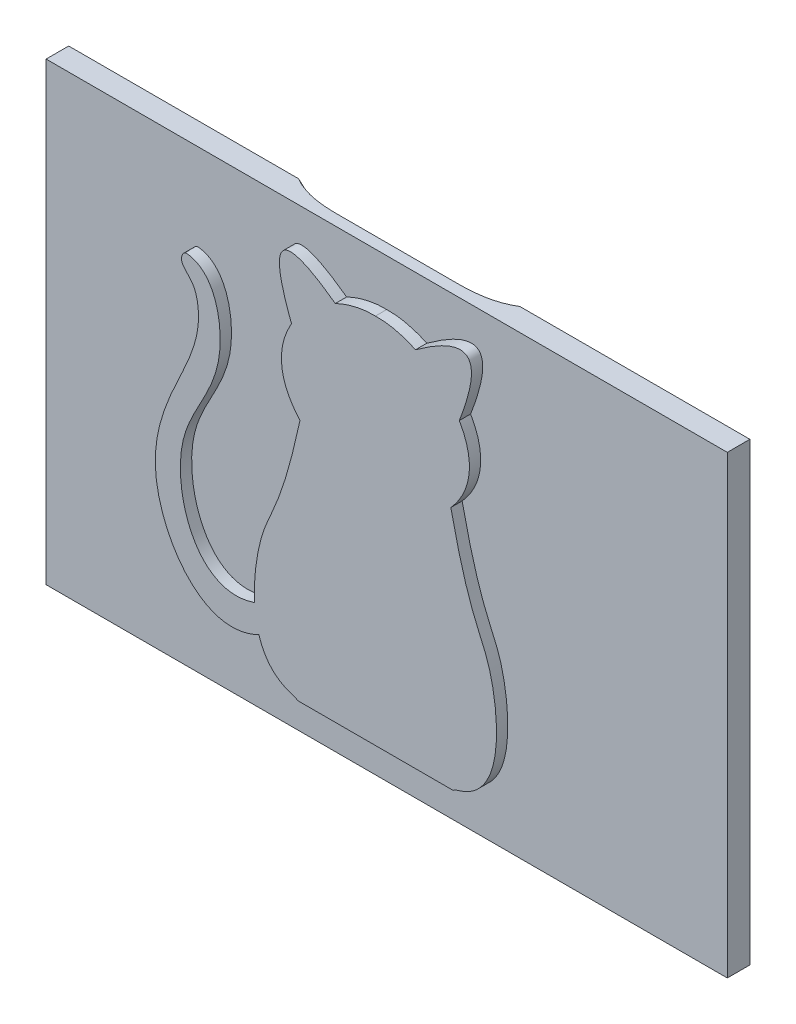
ISO-10303-21;
HEADER;
FILE_DESCRIPTION(('STEP AP214'),'2;1');
FILE_NAME('part.step','',(''),(''),'','','');
FILE_SCHEMA(('AUTOMOTIVE_DESIGN { 1 0 10303 214 1 1 1 1 }'));
ENDSEC;
DATA;
#1=APPLICATION_CONTEXT('core data for automotive mechanical design processes');
#2=APPLICATION_PROTOCOL_DEFINITION('international standard','automotive_design',2000,#1);
#3=PRODUCT_CONTEXT('',#1,'mechanical');
#4=PRODUCT('Part','Part','',(#3));
#5=PRODUCT_RELATED_PRODUCT_CATEGORY('part','',(#4));
#6=PRODUCT_DEFINITION_FORMATION('','',#4);
#7=PRODUCT_DEFINITION_CONTEXT('part definition',#1,'design');
#8=PRODUCT_DEFINITION('design','',#6,#7);
#9=PRODUCT_DEFINITION_SHAPE('','',#8);
#10=(LENGTH_UNIT() NAMED_UNIT(*) SI_UNIT(.MILLI.,.METRE.));
#11=(NAMED_UNIT(*) PLANE_ANGLE_UNIT() SI_UNIT($,.RADIAN.));
#12=(NAMED_UNIT(*) SI_UNIT($,.STERADIAN.) SOLID_ANGLE_UNIT());
#13=UNCERTAINTY_MEASURE_WITH_UNIT(LENGTH_MEASURE(1.E-05),#10,'distance_accuracy_value','');
#14=(GEOMETRIC_REPRESENTATION_CONTEXT(3) GLOBAL_UNCERTAINTY_ASSIGNED_CONTEXT((#13)) GLOBAL_UNIT_ASSIGNED_CONTEXT((#10,
#11,#12)) REPRESENTATION_CONTEXT('',''));
#15=CARTESIAN_POINT('',(0.,0.,0.));
#16=DIRECTION('',(0.,0.,1.));
#17=DIRECTION('',(1.,0.,0.));
#18=AXIS2_PLACEMENT_3D('',#15,#16,#17);
#19=CARTESIAN_POINT('',(0.,20150.,2000.));
#20=DIRECTION('',(0.,1.,0.));
#21=DIRECTION('',(0.,0.,1.));
#22=AXIS2_PLACEMENT_3D('',#19,#20,#21);
#23=PLANE('',#22);
#24=DIRECTION('',(1.,0.,0.));
#25=VECTOR('',#24,1.);
#26=CARTESIAN_POINT('',(0.,20150.,0.));
#27=LINE('',#26,#25);
#28=CARTESIAN_POINT('',(-30150.,20150.,0.));
#29=VERTEX_POINT('',#28);
#30=CARTESIAN_POINT('',(-9797.95897113271,20150.,0.));
#31=VERTEX_POINT('',#30);
#32=EDGE_CURVE('E208',#29,#31,#27,.T.);
#33=ORIENTED_EDGE('',*,*,#32,.F.);
#34=DIRECTION('',(0.,0.,-1.));
#35=VECTOR('',#34,1.);
#36=CARTESIAN_POINT('',(-30150.,20150.,2000.));
#37=LINE('',#36,#35);
#38=CARTESIAN_POINT('',(-30150.,20150.,2000.));
#39=VERTEX_POINT('',#38);
#40=EDGE_CURVE('E224',#39,#29,#37,.T.);
#41=ORIENTED_EDGE('',*,*,#40,.F.);
#42=DIRECTION('',(1.,0.,0.));
#43=VECTOR('',#42,1.);
#44=CARTESIAN_POINT('',(0.,20150.,2000.));
#45=LINE('',#44,#43);
#46=CARTESIAN_POINT('',(30150.,20150.,2000.));
#47=VERTEX_POINT('',#46);
#48=EDGE_CURVE('E193',#39,#47,#45,.T.);
#49=ORIENTED_EDGE('',*,*,#48,.T.);
#50=DIRECTION('',(0.,0.,-1.));
#51=VECTOR('',#50,1.);
#52=CARTESIAN_POINT('',(30150.,20150.,2000.));
#53=LINE('',#52,#51);
#54=CARTESIAN_POINT('',(30150.,20150.,0.));
#55=VERTEX_POINT('',#54);
#56=EDGE_CURVE('E204',#47,#55,#53,.T.);
#57=ORIENTED_EDGE('',*,*,#56,.T.);
#58=CARTESIAN_POINT('',(9797.95897113271,20150.,0.));
#59=VERTEX_POINT('',#58);
#60=EDGE_CURVE('E187',#59,#55,#27,.T.);
#61=ORIENTED_EDGE('',*,*,#60,.F.);
#62=CARTESIAN_POINT('',(9797.95897113271,20150.,0.));
#63=CARTESIAN_POINT('',(9761.41988208664,20150.,22.5524303969973));
#64=CARTESIAN_POINT('',(9724.59290965695,20150.,44.6368886990358));
#65=CARTESIAN_POINT('',(9650.40421567553,20150.,87.8800985631785));
#66=CARTESIAN_POINT('',(9613.04254796276,20150.,109.038942467927));
#67=CARTESIAN_POINT('',(9537.82892550171,20150.,150.43973974739));
#68=CARTESIAN_POINT('',(9499.97711416117,20150.,170.681953851288));
#69=CARTESIAN_POINT('',(9423.80723703039,20150.,210.269948813741));
#70=CARTESIAN_POINT('',(9385.48916577587,20150.,229.615719153738));
#71=CARTESIAN_POINT('',(9308.49734910602,20150.,267.387503724146));
#72=CARTESIAN_POINT('',(9269.82446495539,20150.,285.815274525628));
#73=CARTESIAN_POINT('',(9192.07941393921,20150.,321.807561288052));
#74=CARTESIAN_POINT('',(9153.00724832207,20150.,339.372079947082));
#75=CARTESIAN_POINT('',(9074.49020778691,20150.,373.655279892411));
#76=CARTESIAN_POINT('',(9035.04530439207,20150.,390.373895922276));
#77=CARTESIAN_POINT('',(8955.81364514149,20150.,422.980556485267));
#78=CARTESIAN_POINT('',(8916.02688760993,20150.,438.86859694404));
#79=CARTESIAN_POINT('',(8836.8109651452,20150.,469.570421122937));
#80=CARTESIAN_POINT('',(8797.38706154579,20150.,484.397789839646));
#81=CARTESIAN_POINT('',(8718.25848612919,20150.,513.282824084876));
#82=CARTESIAN_POINT('',(8678.55381464063,20150.,527.340490514192));
#83=CARTESIAN_POINT('',(8598.88754407104,20150.,554.702634011915));
#84=CARTESIAN_POINT('',(8558.92595429708,20150.,568.00713819494));
#85=CARTESIAN_POINT('',(8478.76553109691,20150.,593.880768473882));
#86=CARTESIAN_POINT('',(8438.56669751099,20150.,606.449894074668));
#87=CARTESIAN_POINT('',(8357.93380694829,20150.,630.875638376858));
#88=CARTESIAN_POINT('',(8317.49965352664,20150.,642.731938500107));
#89=CARTESIAN_POINT('',(8236.43258489967,20150.,665.743607315334));
#90=CARTESIAN_POINT('',(8195.79966999225,20150.,676.898977057513));
#91=CARTESIAN_POINT('',(8114.35182568683,20150.,698.526770563085));
#92=CARTESIAN_POINT('',(8073.53689311419,20150.,708.999182364553));
#93=CARTESIAN_POINT('',(7991.74206372828,20150.,729.278729282328));
#94=CARTESIAN_POINT('',(7950.76216602952,20150.,739.08586082247));
#95=CARTESIAN_POINT('',(7858.50608645213,20150.,760.396589253387));
#96=CARTESIAN_POINT('',(7807.18831598243,20150.,771.720430647732));
#97=CARTESIAN_POINT('',(7704.34780632885,20150.,793.395980373851));
#98=CARTESIAN_POINT('',(7652.82506524506,20150.,803.747679672729));
#99=CARTESIAN_POINT('',(7549.59858746108,20150.,823.513971140014));
#100=CARTESIAN_POINT('',(7497.89484490725,20150.,832.92853270585));
#101=CARTESIAN_POINT('',(7394.33145415384,20150.,850.854835478326));
#102=CARTESIAN_POINT('',(7342.47180634018,20150.,859.366578917874));
#103=CARTESIAN_POINT('',(7238.59593199454,20150.,875.525240622696));
#104=CARTESIAN_POINT('',(7186.57964902352,20150.,883.17179551675));
#105=CARTESIAN_POINT('',(7082.43140432684,20150.,897.630445931383));
#106=CARTESIAN_POINT('',(7030.29944253214,20150.,904.442540953801));
#107=CARTESIAN_POINT('',(6925.93880628616,20150.,917.266371578996));
#108=CARTESIAN_POINT('',(6873.71013452656,20150.,923.278129127415));
#109=CARTESIAN_POINT('',(6769.17047333221,20150.,934.535569867085));
#110=CARTESIAN_POINT('',(6716.8594838912,20150.,939.781253000134));
#111=CARTESIAN_POINT('',(6611.0109644174,20150.,949.648372844693));
#112=CARTESIAN_POINT('',(6557.47191007906,20150.,954.253425651115));
#113=CARTESIAN_POINT('',(6450.33620845274,20150.,962.734406381199));
#114=CARTESIAN_POINT('',(6396.73956110956,20150.,966.610333605291));
#115=CARTESIAN_POINT('',(6289.49839763665,20150.,973.668822035325));
#116=CARTESIAN_POINT('',(6235.85387949185,20150.,976.851352522618));
#117=CARTESIAN_POINT('',(6128.52980782957,20150.,982.558178315298));
#118=CARTESIAN_POINT('',(6074.85025419384,20150.,985.082471387182));
#119=CARTESIAN_POINT('',(5967.55761436018,20150.,989.504083146734));
#120=CARTESIAN_POINT('',(5913.94457191239,20150.,991.402468925044));
#121=CARTESIAN_POINT('',(5806.70082283496,20150.,994.612818101669));
#122=CARTESIAN_POINT('',(5753.07011612143,20150.,995.924778673908));
#123=CARTESIAN_POINT('',(5645.80722826107,20150.,997.996444094712));
#124=CARTESIAN_POINT('',(5592.17504892888,20150.,998.756243182074));
#125=CARTESIAN_POINT('',(5511.72386697199,20150.,999.507573924986));
#126=CARTESIAN_POINT('',(5484.90651642911,20150.,999.693289586324));
#127=CARTESIAN_POINT('',(5431.27127770509,20150.,999.939501294235));
#128=CARTESIAN_POINT('',(5404.45338952482,20150.,999.999997529797));
#129=CARTESIAN_POINT('',(5377.63547390407,20150.,1000.));
#130=B_SPLINE_CURVE_WITH_KNOTS('',3,(#62,#63,#64,#65,#66,#67,#68,#69,#70,#71,#72,#73,#74,#75,
#76,#77,#78,#79,#80,#81,#82,#83,#84,#85,#86,#87,#88,#89,#90,#91,#92,#93,#94,#95,#96,#97,#98,#99,
#100,#101,#102,#103,#104,#105,#106,#107,#108,#109,#110,#111,#112,#113,#114,#115,#116,#117,#118,
#119,#120,#121,#122,#123,#124,#125,#126,#127,#128,#129),.UNSPECIFIED.,.F.,.F.,(4,2,2,2,2,2,2,2,
2,2,2,2,2,2,2,2,2,2,2,2,2,2,2,2,2,2,2,2,2,2,2,2,2,4),(0.,128.810880026268,257.608879969084,
386.370011056506,515.132652599615,643.638618320394,772.144182371089,900.659644805643,
1029.17573760833,1155.52758780215,1281.87929012106,1408.22644075184,1534.5736764513,
1660.97696619724,1787.3800665492,1913.78538024221,2040.19137336382,2197.83807379027,
2355.48623888465,2513.13955034904,2670.79247188628,2828.51136233344,2986.23034693639,
3143.94500591722,3301.6596768803,3462.86463376433,3624.06974531795,3785.28199707891,
3946.4947958509,4107.43130915308,4268.36859802519,4429.27841286768,4509.73214672161,
4590.18575915103),.UNSPECIFIED.);
#131=CARTESIAN_POINT('',(5377.63547390407,20150.,1000.));
#132=VERTEX_POINT('',#131);
#133=EDGE_CURVE('E54',#59,#132,#130,.T.);
#134=ORIENTED_EDGE('',*,*,#133,.T.);
#135=DIRECTION('',(-1.,0.,0.));
#136=VECTOR('',#135,1.);
#137=CARTESIAN_POINT('',(0.,20150.,1000.));
#138=LINE('',#137,#136);
#139=CARTESIAN_POINT('',(-5377.63547390407,20150.,1000.));
#140=VERTEX_POINT('',#139);
#141=EDGE_CURVE('E184',#132,#140,#138,.T.);
#142=ORIENTED_EDGE('',*,*,#141,.T.);
#143=CARTESIAN_POINT('',(-5377.63547390407,20150.,1000.));
#144=CARTESIAN_POINT('',(-5407.23069802245,20150.,999.999996322187));
#145=CARTESIAN_POINT('',(-5436.82588665661,20150.,999.926321783097));
#146=CARTESIAN_POINT('',(-5496.01556622456,20150.,999.625940811067));
#147=CARTESIAN_POINT('',(-5525.61005715614,20150.,999.399233944681));
#148=CARTESIAN_POINT('',(-5614.39246867539,20150.,998.481017979675));
#149=CARTESIAN_POINT('',(-5673.57815100913,20150.,997.551413062674));
#150=CARTESIAN_POINT('',(-5791.94925283476,20150.,995.011138348438));
#151=CARTESIAN_POINT('',(-5851.13466881457,20150.,993.400304204505));
#152=CARTESIAN_POINT('',(-5969.48106376254,20150.,989.45128462084));
#153=CARTESIAN_POINT('',(-6028.64204288834,20150.,987.113103949059));
#154=CARTESIAN_POINT('',(-6147.09398681117,20150.,981.65509769488));
#155=CARTESIAN_POINT('',(-6206.38485226677,20150.,978.533103827698));
#156=CARTESIAN_POINT('',(-6324.91767775319,20150.,971.463286673294));
#157=CARTESIAN_POINT('',(-6384.15963768284,20150.,967.515461681938));
#158=CARTESIAN_POINT('',(-6502.57500445274,20150.,958.746418491666));
#159=CARTESIAN_POINT('',(-6561.74841574604,20150.,953.925260647257));
#160=CARTESIAN_POINT('',(-6680.01308492329,20150.,943.361110540607));
#161=CARTESIAN_POINT('',(-6739.10434292751,20150.,937.618119629322));
#162=CARTESIAN_POINT('',(-6855.71012664727,20150.,925.317202513657));
#163=CARTESIAN_POINT('',(-6913.22717210458,20150.,918.783212264086));
#164=CARTESIAN_POINT('',(-7028.14330850096,20150.,904.74716114437));
#165=CARTESIAN_POINT('',(-7085.54239943366,20150.,897.245100222029));
#166=CARTESIAN_POINT('',(-7200.20215072849,20150.,881.226744611732));
#167=CARTESIAN_POINT('',(-7257.46280390012,20150.,872.710398349097));
#168=CARTESIAN_POINT('',(-7371.81662820161,20150.,854.617750209152));
#169=CARTESIAN_POINT('',(-7428.90979958898,20150.,845.041449962462));
#170=CARTESIAN_POINT('',(-7542.84636061357,20150.,824.792125478847));
#171=CARTESIAN_POINT('',(-7599.68993445999,20150.,814.120139543702));
#172=CARTESIAN_POINT('',(-7713.1496510406,20150.,791.625659506724));
#173=CARTESIAN_POINT('',(-7769.7657923992,20150.,779.803158457061));
#174=CARTESIAN_POINT('',(-7882.73051215098,20150.,754.962352565966));
#175=CARTESIAN_POINT('',(-7939.07911345799,20150.,741.944152148172));
#176=CARTESIAN_POINT('',(-8051.47315882387,20150.,714.665265465504));
#177=CARTESIAN_POINT('',(-8107.5186097365,20150.,700.404607416447));
#178=CARTESIAN_POINT('',(-8234.44092280616,20150.,666.546023689665));
#179=CARTESIAN_POINT('',(-8305.21257216496,20150.,646.550323737403));
#180=CARTESIAN_POINT('',(-8410.87724420239,20150.,614.924243578807));
#181=CARTESIAN_POINT('',(-8446.01649962923,20150.,604.110184568524));
#182=CARTESIAN_POINT('',(-8516.11966027601,20150.,581.925681008432));
#183=CARTESIAN_POINT('',(-8551.08356423716,20150.,570.555232470755));
#184=CARTESIAN_POINT('',(-8620.81205329505,20150.,547.249804619967));
#185=CARTESIAN_POINT('',(-8655.57669044033,20150.,535.314981032406));
#186=CARTESIAN_POINT('',(-8724.90133110067,20150.,510.866722522179));
#187=CARTESIAN_POINT('',(-8759.46133807635,20150.,498.35329741629));
#188=CARTESIAN_POINT('',(-8828.3624944516,20150.,472.736264447186));
#189=CARTESIAN_POINT('',(-8862.70364193078,20150.,459.632651413476));
#190=CARTESIAN_POINT('',(-8931.15227167634,20150.,432.823738671725));
#191=CARTESIAN_POINT('',(-8965.25973960546,20150.,419.118402420803));
#192=CARTESIAN_POINT('',(-9068.26165112475,20150.,376.648347832963));
#193=CARTESIAN_POINT('',(-9136.76456263002,20150.,346.926385753337));
#194=CARTESIAN_POINT('',(-9272.57797984894,20150.,284.870885770663));
#195=CARTESIAN_POINT('',(-9339.88851252018,20150.,252.53740700153));
#196=CARTESIAN_POINT('',(-9439.87763639646,20150.,201.996560512411));
#197=CARTESIAN_POINT('',(-9473.06811773527,20150.,184.796381599608));
#198=CARTESIAN_POINT('',(-9539.08372738786,20150.,149.712811861832));
#199=CARTESIAN_POINT('',(-9571.90888089099,20150.,131.82946852264));
#200=CARTESIAN_POINT('',(-9637.17915972675,20150.,95.3659200028186));
#201=CARTESIAN_POINT('',(-9669.62420195078,20150.,76.7855660242985));
#202=CARTESIAN_POINT('',(-9734.10529885489,20150.,38.9217823015464));
#203=CARTESIAN_POINT('',(-9766.14131604484,20150.,19.6382887252337));
#204=CARTESIAN_POINT('',(-9797.95897113271,20150.,2.04345301478808E-13));
#205=B_SPLINE_CURVE_WITH_KNOTS('',3,(#143,#144,#145,#146,#147,#148,#149,#150,#151,#152,#153,
#154,#155,#156,#157,#158,#159,#160,#161,#162,#163,#164,#165,#166,#167,#168,#169,#170,#171,#172,
#173,#174,#175,#176,#177,#178,#179,#180,#181,#182,#183,#184,#185,#186,#187,#188,#189,#190,#191,
#192,#193,#194,#195,#196,#197,#198,#199,#200,#201,#202,#203,#204),.UNSPECIFIED.,.F.,.F.,(4,2,2,
2,2,2,2,2,2,2,2,2,2,2,2,2,2,2,2,2,2,2,2,2,2,2,2,2,2,2,4),(0.,88.7854928620951,177.571237198444,
355.14625662971,532.764140533227,710.380860128541,888.494446727385,1066.60840087412,
1244.71005056969,1422.81143925791,1596.46462425577,1770.1178186167,1943.7798467189,
2117.44160766511,2290.94029486959,2464.44002987777,2637.92462706913,2811.40528550711,
3031.99377703607,3142.28695914577,3252.58093188681,3362.84464727321,3473.10649256901,
3583.36930403051,3693.63882108242,3917.60240168775,4141.56091239158,4253.7018225762,
4365.83495213924,4477.99215766233,4590.15957046087),.UNSPECIFIED.);
#206=EDGE_CURVE('E11',#140,#31,#205,.T.);
#207=ORIENTED_EDGE('',*,*,#206,.T.);
#208=EDGE_LOOP('',(#33,#41,#49,#57,#61,#134,#142,#207));
#209=FACE_BOUND('',#208,.T.);
#210=ADVANCED_FACE('F41',(#209),#23,.T.);
#211=CARTESIAN_POINT('',(-30150.,-5.31584701815559E-12,2000.));
#212=DIRECTION('',(1.,0.,0.));
#213=DIRECTION('',(0.,1.,0.));
#214=AXIS2_PLACEMENT_3D('',#211,#212,#213);
#215=PLANE('',#214);
#216=DIRECTION('',(0.,-1.,0.));
#217=VECTOR('',#216,1.);
#218=CARTESIAN_POINT('',(-30150.,-5.31584701815559E-12,0.));
#219=LINE('',#218,#217);
#220=CARTESIAN_POINT('',(-30150.,-20150.,0.));
#221=VERTEX_POINT('',#220);
#222=EDGE_CURVE('E211',#29,#221,#219,.T.);
#223=ORIENTED_EDGE('',*,*,#222,.T.);
#224=DIRECTION('',(0.,0.,-1.));
#225=VECTOR('',#224,1.);
#226=CARTESIAN_POINT('',(-30150.,-20150.,2000.));
#227=LINE('',#226,#225);
#228=CARTESIAN_POINT('',(-30150.,-20150.,2000.));
#229=VERTEX_POINT('',#228);
#230=EDGE_CURVE('E221',#229,#221,#227,.T.);
#231=ORIENTED_EDGE('',*,*,#230,.F.);
#232=DIRECTION('',(0.,-1.,0.));
#233=VECTOR('',#232,1.);
#234=CARTESIAN_POINT('',(-30150.,-5.31584701815559E-12,2000.));
#235=LINE('',#234,#233);
#236=EDGE_CURVE('E196',#39,#229,#235,.T.);
#237=ORIENTED_EDGE('',*,*,#236,.F.);
#238=ORIENTED_EDGE('',*,*,#40,.T.);
#239=EDGE_LOOP('',(#223,#231,#237,#238));
#240=FACE_BOUND('',#239,.T.);
#241=ADVANCED_FACE('F234',(#240),#215,.F.);
#242=CARTESIAN_POINT('',(0.,-20150.,2000.));
#243=DIRECTION('',(0.,1.,0.));
#244=DIRECTION('',(0.,0.,1.));
#245=AXIS2_PLACEMENT_3D('',#242,#243,#244);
#246=PLANE('',#245);
#247=DIRECTION('',(1.,0.,0.));
#248=VECTOR('',#247,1.);
#249=CARTESIAN_POINT('',(0.,-20150.,0.));
#250=LINE('',#249,#248);
#251=CARTESIAN_POINT('',(30150.,-20150.,0.));
#252=VERTEX_POINT('',#251);
#253=EDGE_CURVE('E213',#221,#252,#250,.T.);
#254=ORIENTED_EDGE('',*,*,#253,.T.);
#255=DIRECTION('',(0.,0.,-1.));
#256=VECTOR('',#255,1.);
#257=CARTESIAN_POINT('',(30150.,-20150.,2000.));
#258=LINE('',#257,#256);
#259=CARTESIAN_POINT('',(30150.,-20150.,2000.));
#260=VERTEX_POINT('',#259);
#261=EDGE_CURVE('E219',#260,#252,#258,.T.);
#262=ORIENTED_EDGE('',*,*,#261,.F.);
#263=DIRECTION('',(1.,0.,0.));
#264=VECTOR('',#263,1.);
#265=CARTESIAN_POINT('',(0.,-20150.,2000.));
#266=LINE('',#265,#264);
#267=EDGE_CURVE('E199',#229,#260,#266,.T.);
#268=ORIENTED_EDGE('',*,*,#267,.F.);
#269=ORIENTED_EDGE('',*,*,#230,.T.);
#270=EDGE_LOOP('',(#254,#262,#268,#269));
#271=FACE_BOUND('',#270,.T.);
#272=ADVANCED_FACE('F239',(#271),#246,.F.);
#273=CARTESIAN_POINT('',(30150.,5.31584701815559E-12,2000.));
#274=DIRECTION('',(1.,0.,0.));
#275=DIRECTION('',(0.,1.,0.));
#276=AXIS2_PLACEMENT_3D('',#273,#274,#275);
#277=PLANE('',#276);
#278=DIRECTION('',(0.,-1.,0.));
#279=VECTOR('',#278,1.);
#280=CARTESIAN_POINT('',(30150.,5.31584701815559E-12,0.));
#281=LINE('',#280,#279);
#282=EDGE_CURVE('E197',#55,#252,#281,.T.);
#283=ORIENTED_EDGE('',*,*,#282,.F.);
#284=ORIENTED_EDGE('',*,*,#56,.F.);
#285=DIRECTION('',(0.,-1.,0.));
#286=VECTOR('',#285,1.);
#287=CARTESIAN_POINT('',(30150.,5.31584701815559E-12,2000.));
#288=LINE('',#287,#286);
#289=EDGE_CURVE('E201',#47,#260,#288,.T.);
#290=ORIENTED_EDGE('',*,*,#289,.T.);
#291=ORIENTED_EDGE('',*,*,#261,.T.);
#292=EDGE_LOOP('',(#283,#284,#290,#291));
#293=FACE_BOUND('',#292,.T.);
#294=ADVANCED_FACE('F243',(#293),#277,.T.);
#295=CARTESIAN_POINT('',(0.,0.,2000.));
#296=DIRECTION('',(0.,0.,1.));
#297=DIRECTION('',(1.,0.,0.));
#298=AXIS2_PLACEMENT_3D('',#295,#296,#297);
#299=PLANE('',#298);
#300=CARTESIAN_POINT('',(-10701.4154024508,-11295.0990903512,2000.));
#301=CARTESIAN_POINT('',(-15811.502818911,-13035.4860460302,2000.));
#302=CARTESIAN_POINT('',(-19505.2982973439,-2003.0705480653,2000.));
#303=CARTESIAN_POINT('',(-12595.1440772474,4316.28380770958,2000.));
#304=CARTESIAN_POINT('',(-14193.3303611078,12218.8684991821,2000.));
#305=CARTESIAN_POINT('',(-17013.9672801186,12506.8573656612,2000.));
#306=CARTESIAN_POINT('',(-17294.0971199598,11747.511080652,2000.));
#307=CARTESIAN_POINT('',(-16814.7225333797,11104.5485681769,2000.));
#308=CARTESIAN_POINT('',(-16001.3411175717,10377.5950037917,2000.));
#309=CARTESIAN_POINT('',(-15085.5432861098,6773.9322090183,2000.));
#310=CARTESIAN_POINT('',(-18212.2035127535,1514.95643944773,2000.));
#311=CARTESIAN_POINT('',(-21021.3950702969,-7650.69425907075,2000.));
#312=CARTESIAN_POINT('',(-15118.8037914611,-15967.3218889908,2000.));
#313=CARTESIAN_POINT('',(-10319.8204823041,-13558.5923700428,2000.));
#314=B_SPLINE_CURVE_WITH_KNOTS('',3,(#300,#301,#302,#303,#304,#305,#306,#307,#308,#309,#310,
#311,#312,#313),.UNSPECIFIED.,.F.,.F.,(4,1,1,1,1,1,1,1,1,1,1,4),(0.,0.209738333299947,
0.351877252549411,0.464529446640048,0.468874967403861,0.481926302008583,0.49109213703462,
0.506999650371834,0.53438095850906,0.661271136689176,0.783505042685204,1.),.UNSPECIFIED.);
#315=CARTESIAN_POINT('',(-10701.4154024509,-11295.0990903497,2000.));
#316=VERTEX_POINT('',#315);
#317=CARTESIAN_POINT('',(-10319.8204823041,-13558.5923700428,2000.));
#318=VERTEX_POINT('',#317);
#319=EDGE_CURVE('E61',#316,#318,#314,.T.);
#320=ORIENTED_EDGE('',*,*,#319,.F.);
#321=CARTESIAN_POINT('',(-6676.07537101492,4682.99423373112,2000.));
#322=CARTESIAN_POINT('',(-8517.11880066394,-3858.03190167887,2000.));
#323=CARTESIAN_POINT('',(-10479.6714668028,-3136.2315654846,2000.));
#324=CARTESIAN_POINT('',(-11366.3586580657,-15716.5621665728,2000.));
#325=CARTESIAN_POINT('',(-7098.20192861061,-16739.7346242678,2000.));
#326=CARTESIAN_POINT('',(-6873.52996803956,-16899.9734146052,2000.));
#327=B_SPLINE_CURVE_WITH_KNOTS('',3,(#321,#322,#323,#324,#325,#326),.UNSPECIFIED.,.F.,.F.,(4,1,
1,4),(0.,0.530592574483586,0.981482989013449,1.),.UNSPECIFIED.);
#328=CARTESIAN_POINT('',(-6676.07537101492,4682.99423373112,2000.));
#329=VERTEX_POINT('',#328);
#330=EDGE_CURVE('E65',#329,#316,#327,.T.);
#331=ORIENTED_EDGE('',*,*,#330,.F.);
#332=CARTESIAN_POINT('',(5.05618638453653E-13,16021.3104969883,2000.));
#333=CARTESIAN_POINT('',(-5236.02936953673,16166.060205488,2000.));
#334=CARTESIAN_POINT('',(-11298.7266637612,9807.38599491692,2000.));
#335=CARTESIAN_POINT('',(-6676.07537101492,4682.99423373112,2000.));
#336=B_SPLINE_CURVE_WITH_KNOTS('',3,(#332,#333,#334,#335),.UNSPECIFIED.,.F.,.F.,(4,4),(0.,1.),.UNSPECIFIED.);
#337=CARTESIAN_POINT('',(-7427.64984550699,11726.3098517818,2000.));
#338=VERTEX_POINT('',#337);
#339=EDGE_CURVE('E359',#338,#329,#336,.T.);
#340=ORIENTED_EDGE('',*,*,#339,.F.);
#341=CARTESIAN_POINT('',(-3548.12269758677,15210.2003385635,2000.));
#342=CARTESIAN_POINT('',(-10798.6263947552,20491.6880500602,2000.));
#343=CARTESIAN_POINT('',(-7427.64984550699,11726.3098517818,2000.));
#344=B_SPLINE_CURVE_WITH_KNOTS('',2,(#341,#342,#343),.UNSPECIFIED.,.F.,.F.,(3,3),(0.,1.),.UNSPECIFIED.);
#345=CARTESIAN_POINT('',(-3548.12269758677,15210.2003385635,2000.));
#346=VERTEX_POINT('',#345);
#347=EDGE_CURVE('E358',#346,#338,#344,.T.);
#348=ORIENTED_EDGE('',*,*,#347,.F.);
#349=CARTESIAN_POINT('',(5.05618638453653E-13,16021.3104969883,2000.));
#350=VERTEX_POINT('',#349);
#351=EDGE_CURVE('E350',#350,#346,#336,.T.);
#352=ORIENTED_EDGE('',*,*,#351,.F.);
#353=CARTESIAN_POINT('',(5.05618638453653E-13,16021.3104969883,2000.));
#354=CARTESIAN_POINT('',(5236.02936953673,16166.060205488,2000.));
#355=CARTESIAN_POINT('',(11298.7266637612,9807.38599491692,2000.));
#356=CARTESIAN_POINT('',(6676.07537101492,4682.99423373112,2000.));
#357=B_SPLINE_CURVE_WITH_KNOTS('',3,(#353,#354,#355,#356),.UNSPECIFIED.,.F.,.F.,(4,4),(0.,1.),.UNSPECIFIED.);
#358=CARTESIAN_POINT('',(3548.12269758677,15210.2003385635,2000.));
#359=VERTEX_POINT('',#358);
#360=EDGE_CURVE('E343',#350,#359,#357,.T.);
#361=ORIENTED_EDGE('',*,*,#360,.T.);
#362=CARTESIAN_POINT('',(3548.12269758677,15210.2003385635,2000.));
#363=CARTESIAN_POINT('',(10798.6263947552,20491.6880500602,2000.));
#364=CARTESIAN_POINT('',(7427.64984550699,11726.3098517818,2000.));
#365=B_SPLINE_CURVE_WITH_KNOTS('',2,(#362,#363,#364),.UNSPECIFIED.,.F.,.F.,(3,3),(0.,1.),.UNSPECIFIED.);
#366=CARTESIAN_POINT('',(7427.64984550699,11726.3098517818,2000.));
#367=VERTEX_POINT('',#366);
#368=EDGE_CURVE('E342',#359,#367,#365,.T.);
#369=ORIENTED_EDGE('',*,*,#368,.T.);
#370=CARTESIAN_POINT('',(6676.07537101492,4682.99423373112,2000.));
#371=VERTEX_POINT('',#370);
#372=EDGE_CURVE('E335',#367,#371,#357,.T.);
#373=ORIENTED_EDGE('',*,*,#372,.T.);
#374=CARTESIAN_POINT('',(6676.07537101492,4682.99423373112,2000.));
#375=CARTESIAN_POINT('',(8517.11880066395,-3858.03190167886,2000.));
#376=CARTESIAN_POINT('',(10479.6714668029,-3136.23156548461,2000.));
#377=CARTESIAN_POINT('',(11366.3586580657,-15716.5621665728,2000.));
#378=CARTESIAN_POINT('',(7098.20192861062,-16739.7346242678,2000.));
#379=CARTESIAN_POINT('',(6873.52996803957,-16899.9734146052,2000.));
#380=B_SPLINE_CURVE_WITH_KNOTS('',3,(#374,#375,#376,#377,#378,#379),.UNSPECIFIED.,.F.,.F.,(4,1,
1,4),(0.,0.530592574483586,0.981482989013449,1.),.UNSPECIFIED.);
#381=CARTESIAN_POINT('',(6873.52996803958,-16899.9734146052,2000.));
#382=VERTEX_POINT('',#381);
#383=EDGE_CURVE('E331',#371,#382,#380,.T.);
#384=ORIENTED_EDGE('',*,*,#383,.T.);
#385=DIRECTION('',(1.,0.,0.));
#386=VECTOR('',#385,1.);
#387=CARTESIAN_POINT('',(0.,-16899.9734146052,2000.));
#388=LINE('',#387,#386);
#389=CARTESIAN_POINT('',(-6873.52996803958,-16899.9734146052,2000.));
#390=VERTEX_POINT('',#389);
#391=EDGE_CURVE('E325',#390,#382,#388,.T.);
#392=ORIENTED_EDGE('',*,*,#391,.F.);
#393=EDGE_CURVE('E318',#318,#390,#327,.T.);
#394=ORIENTED_EDGE('',*,*,#393,.F.);
#395=EDGE_LOOP('',(#320,#331,#340,#348,#352,#361,#369,#373,#384,#392,#394));
#396=FACE_BOUND('',#395,.T.);
#397=ORIENTED_EDGE('',*,*,#48,.F.);
#398=ORIENTED_EDGE('',*,*,#236,.T.);
#399=ORIENTED_EDGE('',*,*,#267,.T.);
#400=ORIENTED_EDGE('',*,*,#289,.F.);
#401=EDGE_LOOP('',(#397,#398,#399,#400));
#402=FACE_BOUND('',#401,.T.);
#403=ADVANCED_FACE('F247',(#396,#402),#299,.T.);
#404=CARTESIAN_POINT('',(0.,0.,0.));
#405=DIRECTION('',(0.,0.,1.));
#406=DIRECTION('',(1.,0.,0.));
#407=AXIS2_PLACEMENT_3D('',#404,#405,#406);
#408=PLANE('',#407);
#409=ORIENTED_EDGE('',*,*,#60,.T.);
#410=ORIENTED_EDGE('',*,*,#282,.T.);
#411=ORIENTED_EDGE('',*,*,#253,.F.);
#412=ORIENTED_EDGE('',*,*,#222,.F.);
#413=ORIENTED_EDGE('',*,*,#32,.T.);
#414=CARTESIAN_POINT('',(0.,30150.,0.));
#415=DIRECTION('',(0.,0.,1.));
#416=DIRECTION('',(1.,0.,0.));
#417=AXIS2_PLACEMENT_3D('',#414,#415,#416);
#418=CIRCLE('',#417,14000.);
#419=EDGE_CURVE('E207',#59,#31,#418,.F.);
#420=ORIENTED_EDGE('',*,*,#419,.F.);
#421=EDGE_LOOP('',(#409,#410,#411,#412,#413,#420));
#422=FACE_BOUND('',#421,.T.);
#423=ADVANCED_FACE('F249',(#422),#408,.F.);
#424=CARTESIAN_POINT('',(0.,30150.,1000.));
#425=DIRECTION('',(0.,0.,1.));
#426=DIRECTION('',(1.,0.,0.));
#427=AXIS2_PLACEMENT_3D('',#424,#425,#426);
#428=PLANE('',#427);
#429=ORIENTED_EDGE('',*,*,#141,.F.);
#430=CARTESIAN_POINT('',(0.,30150.,1000.));
#431=DIRECTION('',(0.,0.,1.));
#432=DIRECTION('',(1.,0.,0.));
#433=AXIS2_PLACEMENT_3D('',#430,#431,#432);
#434=CIRCLE('',#433,11354.2486889354);
#435=EDGE_CURVE('E226',#132,#140,#434,.F.);
#436=ORIENTED_EDGE('',*,*,#435,.T.);
#437=EDGE_LOOP('',(#429,#436));
#438=FACE_BOUND('',#437,.T.);
#439=ADVANCED_FACE('F252',(#438),#428,.F.);
#440=CARTESIAN_POINT('',(0.,30150.,-3000.));
#441=DIRECTION('',(0.,0.,-1.));
#442=DIRECTION('',(-1.,0.,0.));
#443=AXIS2_PLACEMENT_3D('',#440,#441,#442);
#444=TOROIDAL_SURFACE('',#443,11354.2486889354,4000.);
#445=ORIENTED_EDGE('',*,*,#206,.F.);
#446=ORIENTED_EDGE('',*,*,#435,.F.);
#447=ORIENTED_EDGE('',*,*,#133,.F.);
#448=ORIENTED_EDGE('',*,*,#419,.T.);
#449=EDGE_LOOP('',(#445,#446,#447,#448));
#450=FACE_BOUND('',#449,.T.);
#451=ADVANCED_FACE('F43',(#450),#444,.F.);
#452=CARTESIAN_POINT('',(-10701.4154024508,-11295.0990903512,3000.));
#453=CARTESIAN_POINT('',(-15811.502818911,-13035.4860460302,3000.));
#454=CARTESIAN_POINT('',(-19505.2982973439,-2003.0705480653,3000.));
#455=CARTESIAN_POINT('',(-12595.1440772474,4316.28380770958,3000.));
#456=CARTESIAN_POINT('',(-14193.3303611078,12218.8684991821,3000.));
#457=CARTESIAN_POINT('',(-17013.9672801186,12506.8573656612,3000.));
#458=CARTESIAN_POINT('',(-17294.0971199598,11747.511080652,3000.));
#459=CARTESIAN_POINT('',(-16814.7225333797,11104.5485681769,3000.));
#460=CARTESIAN_POINT('',(-16001.3411175717,10377.5950037917,3000.));
#461=CARTESIAN_POINT('',(-15085.5432861098,6773.9322090183,3000.));
#462=CARTESIAN_POINT('',(-18212.2035127535,1514.95643944773,3000.));
#463=CARTESIAN_POINT('',(-21021.3950702969,-7650.69425907075,3000.));
#464=CARTESIAN_POINT('',(-15118.8037914611,-15967.3218889908,3000.));
#465=CARTESIAN_POINT('',(-10319.8204823041,-13558.5923700428,3000.));
#466=B_SPLINE_CURVE_WITH_KNOTS('',3,(#452,#453,#454,#455,#456,#457,#458,#459,#460,#461,#462,
#463,#464,#465),.UNSPECIFIED.,.F.,.F.,(4,1,1,1,1,1,1,1,1,1,1,4),(0.,0.209738333299947,
0.351877252549411,0.464529446640048,0.468874967403861,0.481926302008583,0.49109213703462,
0.506999650371834,0.53438095850906,0.661271136689176,0.783505042685204,1.),.UNSPECIFIED.);
#467=DIRECTION('',(0.,0.,-1.));
#468=VECTOR('',#467,1.);
#469=SURFACE_OF_LINEAR_EXTRUSION('',#466,#468);
#470=ORIENTED_EDGE('',*,*,#319,.T.);
#471=DIRECTION('',(0.,0.,-1.));
#472=VECTOR('',#471,1.);
#473=CARTESIAN_POINT('',(-10319.8204823041,-13558.5923700428,3000.));
#474=LINE('',#473,#472);
#475=CARTESIAN_POINT('',(-10319.8204823041,-13558.5923700428,3000.));
#476=VERTEX_POINT('',#475);
#477=EDGE_CURVE('E167',#476,#318,#474,.T.);
#478=ORIENTED_EDGE('',*,*,#477,.F.);
#479=CARTESIAN_POINT('',(-10701.4154024509,-11295.0990903497,3000.));
#480=VERTEX_POINT('',#479);
#481=EDGE_CURVE('E173',#480,#476,#466,.T.);
#482=ORIENTED_EDGE('',*,*,#481,.F.);
#483=DIRECTION('',(0.,0.,-1.));
#484=VECTOR('',#483,1.);
#485=CARTESIAN_POINT('',(-10701.4154024509,-11295.0990903497,3000.));
#486=LINE('',#485,#484);
#487=EDGE_CURVE('E367',#480,#316,#486,.T.);
#488=ORIENTED_EDGE('',*,*,#487,.T.);
#489=EDGE_LOOP('',(#470,#478,#482,#488));
#490=FACE_BOUND('',#489,.T.);
#491=ADVANCED_FACE('F183',(#490),#469,.F.);
#492=CARTESIAN_POINT('',(-6676.07537101492,4682.99423373112,3000.));
#493=CARTESIAN_POINT('',(-8517.11880066394,-3858.03190167887,3000.));
#494=CARTESIAN_POINT('',(-10479.6714668028,-3136.2315654846,3000.));
#495=CARTESIAN_POINT('',(-11366.3586580657,-15716.5621665728,3000.));
#496=CARTESIAN_POINT('',(-7098.20192861061,-16739.7346242678,3000.));
#497=CARTESIAN_POINT('',(-6873.52996803956,-16899.9734146052,3000.));
#498=B_SPLINE_CURVE_WITH_KNOTS('',3,(#492,#493,#494,#495,#496,#497),.UNSPECIFIED.,.F.,.F.,(4,1,
1,4),(0.,0.530592574483586,0.981482989013449,1.),.UNSPECIFIED.);
#499=DIRECTION('',(0.,0.,-1.));
#500=VECTOR('',#499,1.);
#501=SURFACE_OF_LINEAR_EXTRUSION('',#498,#500);
#502=ORIENTED_EDGE('',*,*,#393,.T.);
#503=DIRECTION('',(0.,0.,-1.));
#504=VECTOR('',#503,1.);
#505=CARTESIAN_POINT('',(-6873.52996803958,-16899.9734146052,3000.));
#506=LINE('',#505,#504);
#507=CARTESIAN_POINT('',(-6873.52996803958,-16899.9734146052,3000.));
#508=VERTEX_POINT('',#507);
#509=EDGE_CURVE('E169',#508,#390,#506,.T.);
#510=ORIENTED_EDGE('',*,*,#509,.F.);
#511=EDGE_CURVE('E162',#476,#508,#498,.T.);
#512=ORIENTED_EDGE('',*,*,#511,.F.);
#513=ORIENTED_EDGE('',*,*,#477,.T.);
#514=EDGE_LOOP('',(#502,#510,#512,#513));
#515=FACE_BOUND('',#514,.T.);
#516=ADVANCED_FACE('F165',(#515),#501,.F.);
#517=CARTESIAN_POINT('',(0.,-16899.9734146052,3000.));
#518=DIRECTION('',(0.,1.,0.));
#519=DIRECTION('',(0.,0.,1.));
#520=AXIS2_PLACEMENT_3D('',#517,#518,#519);
#521=PLANE('',#520);
#522=ORIENTED_EDGE('',*,*,#391,.T.);
#523=DIRECTION('',(0.,0.,-1.));
#524=VECTOR('',#523,1.);
#525=CARTESIAN_POINT('',(6873.52996803958,-16899.9734146052,3000.));
#526=LINE('',#525,#524);
#527=CARTESIAN_POINT('',(6873.52996803958,-16899.9734146052,3000.));
#528=VERTEX_POINT('',#527);
#529=EDGE_CURVE('E189',#528,#382,#526,.T.);
#530=ORIENTED_EDGE('',*,*,#529,.F.);
#531=DIRECTION('',(1.,0.,0.));
#532=VECTOR('',#531,1.);
#533=CARTESIAN_POINT('',(0.,-16899.9734146052,3000.));
#534=LINE('',#533,#532);
#535=EDGE_CURVE('E172',#508,#528,#534,.T.);
#536=ORIENTED_EDGE('',*,*,#535,.F.);
#537=ORIENTED_EDGE('',*,*,#509,.T.);
#538=EDGE_LOOP('',(#522,#530,#536,#537));
#539=FACE_BOUND('',#538,.T.);
#540=ADVANCED_FACE('F261',(#539),#521,.F.);
#541=CARTESIAN_POINT('',(6676.07537101492,4682.99423373112,3000.));
#542=CARTESIAN_POINT('',(8517.11880066395,-3858.03190167886,3000.));
#543=CARTESIAN_POINT('',(10479.6714668029,-3136.23156548461,3000.));
#544=CARTESIAN_POINT('',(11366.3586580657,-15716.5621665728,3000.));
#545=CARTESIAN_POINT('',(7098.20192861062,-16739.7346242678,3000.));
#546=CARTESIAN_POINT('',(6873.52996803957,-16899.9734146052,3000.));
#547=B_SPLINE_CURVE_WITH_KNOTS('',3,(#541,#542,#543,#544,#545,#546),.UNSPECIFIED.,.F.,.F.,(4,1,
1,4),(0.,0.530592574483586,0.981482989013449,1.),.UNSPECIFIED.);
#548=DIRECTION('',(0.,0.,-1.));
#549=VECTOR('',#548,1.);
#550=SURFACE_OF_LINEAR_EXTRUSION('',#547,#549);
#551=ORIENTED_EDGE('',*,*,#383,.F.);
#552=DIRECTION('',(0.,0.,-1.));
#553=VECTOR('',#552,1.);
#554=CARTESIAN_POINT('',(6676.07537101492,4682.99423373112,3000.));
#555=LINE('',#554,#553);
#556=CARTESIAN_POINT('',(6676.07537101492,4682.99423373112,3000.));
#557=VERTEX_POINT('',#556);
#558=EDGE_CURVE('E390',#557,#371,#555,.T.);
#559=ORIENTED_EDGE('',*,*,#558,.F.);
#560=EDGE_CURVE('E399',#557,#528,#547,.T.);
#561=ORIENTED_EDGE('',*,*,#560,.T.);
#562=ORIENTED_EDGE('',*,*,#529,.T.);
#563=EDGE_LOOP('',(#551,#559,#561,#562));
#564=FACE_BOUND('',#563,.T.);
#565=ADVANCED_FACE('F397',(#564),#550,.T.);
#566=CARTESIAN_POINT('',(5.05618638453653E-13,16021.3104969883,3000.));
#567=CARTESIAN_POINT('',(5236.02936953673,16166.060205488,3000.));
#568=CARTESIAN_POINT('',(11298.7266637612,9807.38599491692,3000.));
#569=CARTESIAN_POINT('',(6676.07537101492,4682.99423373112,3000.));
#570=B_SPLINE_CURVE_WITH_KNOTS('',3,(#566,#567,#568,#569),.UNSPECIFIED.,.F.,.F.,(4,4),(0.,1.),.UNSPECIFIED.);
#571=DIRECTION('',(0.,0.,-1.));
#572=VECTOR('',#571,1.);
#573=SURFACE_OF_LINEAR_EXTRUSION('',#570,#572);
#574=ORIENTED_EDGE('',*,*,#372,.F.);
#575=DIRECTION('',(0.,0.,-1.));
#576=VECTOR('',#575,1.);
#577=CARTESIAN_POINT('',(7427.64984550699,11726.3098517818,3000.));
#578=LINE('',#577,#576);
#579=CARTESIAN_POINT('',(7427.64984550699,11726.3098517818,3000.));
#580=VERTEX_POINT('',#579);
#581=EDGE_CURVE('E387',#580,#367,#578,.T.);
#582=ORIENTED_EDGE('',*,*,#581,.F.);
#583=EDGE_CURVE('E408',#580,#557,#570,.T.);
#584=ORIENTED_EDGE('',*,*,#583,.T.);
#585=ORIENTED_EDGE('',*,*,#558,.T.);
#586=EDGE_LOOP('',(#574,#582,#584,#585));
#587=FACE_BOUND('',#586,.T.);
#588=ADVANCED_FACE('F406',(#587),#573,.T.);
#589=CARTESIAN_POINT('',(3548.12269758677,15210.2003385635,3000.));
#590=CARTESIAN_POINT('',(10798.6263947552,20491.6880500602,3000.));
#591=CARTESIAN_POINT('',(7427.64984550699,11726.3098517818,3000.));
#592=B_SPLINE_CURVE_WITH_KNOTS('',2,(#589,#590,#591),.UNSPECIFIED.,.F.,.F.,(3,3),(0.,1.),.UNSPECIFIED.);
#593=DIRECTION('',(0.,0.,-1.));
#594=VECTOR('',#593,1.);
#595=SURFACE_OF_LINEAR_EXTRUSION('',#592,#594);
#596=ORIENTED_EDGE('',*,*,#368,.F.);
#597=DIRECTION('',(0.,0.,-1.));
#598=VECTOR('',#597,1.);
#599=CARTESIAN_POINT('',(3548.12269758677,15210.2003385635,3000.));
#600=LINE('',#599,#598);
#601=CARTESIAN_POINT('',(3548.12269758677,15210.2003385635,3000.));
#602=VERTEX_POINT('',#601);
#603=EDGE_CURVE('E384',#602,#359,#600,.T.);
#604=ORIENTED_EDGE('',*,*,#603,.F.);
#605=EDGE_CURVE('E300',#602,#580,#592,.T.);
#606=ORIENTED_EDGE('',*,*,#605,.T.);
#607=ORIENTED_EDGE('',*,*,#581,.T.);
#608=EDGE_LOOP('',(#596,#604,#606,#607));
#609=FACE_BOUND('',#608,.T.);
#610=ADVANCED_FACE('F422',(#609),#595,.T.);
#611=ORIENTED_EDGE('',*,*,#360,.F.);
#612=DIRECTION('',(0.,0.,-1.));
#613=VECTOR('',#612,1.);
#614=CARTESIAN_POINT('',(5.05618638453653E-13,16021.3104969883,3000.));
#615=LINE('',#614,#613);
#616=CARTESIAN_POINT('',(5.05618638453653E-13,16021.3104969883,3000.));
#617=VERTEX_POINT('',#616);
#618=EDGE_CURVE('E381',#617,#350,#615,.T.);
#619=ORIENTED_EDGE('',*,*,#618,.F.);
#620=EDGE_CURVE('E298',#617,#602,#570,.T.);
#621=ORIENTED_EDGE('',*,*,#620,.T.);
#622=ORIENTED_EDGE('',*,*,#603,.T.);
#623=EDGE_LOOP('',(#611,#619,#621,#622));
#624=FACE_BOUND('',#623,.T.);
#625=ADVANCED_FACE('F424',(#624),#573,.T.);
#626=CARTESIAN_POINT('',(5.05618638453653E-13,16021.3104969883,3000.));
#627=CARTESIAN_POINT('',(-5236.02936953673,16166.060205488,3000.));
#628=CARTESIAN_POINT('',(-11298.7266637612,9807.38599491692,3000.));
#629=CARTESIAN_POINT('',(-6676.07537101492,4682.99423373112,3000.));
#630=B_SPLINE_CURVE_WITH_KNOTS('',3,(#626,#627,#628,#629),.UNSPECIFIED.,.F.,.F.,(4,4),(0.,1.),.UNSPECIFIED.);
#631=DIRECTION('',(0.,0.,-1.));
#632=VECTOR('',#631,1.);
#633=SURFACE_OF_LINEAR_EXTRUSION('',#630,#632);
#634=ORIENTED_EDGE('',*,*,#351,.T.);
#635=DIRECTION('',(0.,0.,-1.));
#636=VECTOR('',#635,1.);
#637=CARTESIAN_POINT('',(-3548.12269758677,15210.2003385635,3000.));
#638=LINE('',#637,#636);
#639=CARTESIAN_POINT('',(-3548.12269758677,15210.2003385635,3000.));
#640=VERTEX_POINT('',#639);
#641=EDGE_CURVE('E378',#640,#346,#638,.T.);
#642=ORIENTED_EDGE('',*,*,#641,.F.);
#643=EDGE_CURVE('E292',#617,#640,#630,.T.);
#644=ORIENTED_EDGE('',*,*,#643,.F.);
#645=ORIENTED_EDGE('',*,*,#618,.T.);
#646=EDGE_LOOP('',(#634,#642,#644,#645));
#647=FACE_BOUND('',#646,.T.);
#648=ADVANCED_FACE('F289',(#647),#633,.F.);
#649=CARTESIAN_POINT('',(-3548.12269758677,15210.2003385635,3000.));
#650=CARTESIAN_POINT('',(-10798.6263947552,20491.6880500602,3000.));
#651=CARTESIAN_POINT('',(-7427.64984550699,11726.3098517818,3000.));
#652=B_SPLINE_CURVE_WITH_KNOTS('',2,(#649,#650,#651),.UNSPECIFIED.,.F.,.F.,(3,3),(0.,1.),.UNSPECIFIED.);
#653=DIRECTION('',(0.,0.,-1.));
#654=VECTOR('',#653,1.);
#655=SURFACE_OF_LINEAR_EXTRUSION('',#652,#654);
#656=ORIENTED_EDGE('',*,*,#347,.T.);
#657=DIRECTION('',(0.,0.,-1.));
#658=VECTOR('',#657,1.);
#659=CARTESIAN_POINT('',(-7427.64984550699,11726.3098517818,3000.));
#660=LINE('',#659,#658);
#661=CARTESIAN_POINT('',(-7427.64984550699,11726.3098517818,3000.));
#662=VERTEX_POINT('',#661);
#663=EDGE_CURVE('E375',#662,#338,#660,.T.);
#664=ORIENTED_EDGE('',*,*,#663,.F.);
#665=EDGE_CURVE('E297',#640,#662,#652,.T.);
#666=ORIENTED_EDGE('',*,*,#665,.F.);
#667=ORIENTED_EDGE('',*,*,#641,.T.);
#668=EDGE_LOOP('',(#656,#664,#666,#667));
#669=FACE_BOUND('',#668,.T.);
#670=ADVANCED_FACE('F287',(#669),#655,.F.);
#671=ORIENTED_EDGE('',*,*,#339,.T.);
#672=DIRECTION('',(0.,0.,-1.));
#673=VECTOR('',#672,1.);
#674=CARTESIAN_POINT('',(-6676.07537101492,4682.99423373112,3000.));
#675=LINE('',#674,#673);
#676=CARTESIAN_POINT('',(-6676.07537101492,4682.99423373112,3000.));
#677=VERTEX_POINT('',#676);
#678=EDGE_CURVE('E372',#677,#329,#675,.T.);
#679=ORIENTED_EDGE('',*,*,#678,.F.);
#680=EDGE_CURVE('E299',#662,#677,#630,.T.);
#681=ORIENTED_EDGE('',*,*,#680,.F.);
#682=ORIENTED_EDGE('',*,*,#663,.T.);
#683=EDGE_LOOP('',(#671,#679,#681,#682));
#684=FACE_BOUND('',#683,.T.);
#685=ADVANCED_FACE('F282',(#684),#633,.F.);
#686=ORIENTED_EDGE('',*,*,#330,.T.);
#687=ORIENTED_EDGE('',*,*,#487,.F.);
#688=EDGE_CURVE('E175',#677,#480,#498,.T.);
#689=ORIENTED_EDGE('',*,*,#688,.F.);
#690=ORIENTED_EDGE('',*,*,#678,.T.);
#691=EDGE_LOOP('',(#686,#687,#689,#690));
#692=FACE_BOUND('',#691,.T.);
#693=ADVANCED_FACE('F278',(#692),#501,.F.);
#694=CARTESIAN_POINT('',(0.,0.,3000.));
#695=DIRECTION('',(0.,0.,1.));
#696=DIRECTION('',(1.,0.,0.));
#697=AXIS2_PLACEMENT_3D('',#694,#695,#696);
#698=PLANE('',#697);
#699=ORIENTED_EDGE('',*,*,#481,.T.);
#700=ORIENTED_EDGE('',*,*,#511,.T.);
#701=ORIENTED_EDGE('',*,*,#535,.T.);
#702=ORIENTED_EDGE('',*,*,#560,.F.);
#703=ORIENTED_EDGE('',*,*,#583,.F.);
#704=ORIENTED_EDGE('',*,*,#605,.F.);
#705=ORIENTED_EDGE('',*,*,#620,.F.);
#706=ORIENTED_EDGE('',*,*,#643,.T.);
#707=ORIENTED_EDGE('',*,*,#665,.T.);
#708=ORIENTED_EDGE('',*,*,#680,.T.);
#709=ORIENTED_EDGE('',*,*,#688,.T.);
#710=EDGE_LOOP('',(#699,#700,#701,#702,#703,#704,#705,#706,#707,#708,#709));
#711=FACE_BOUND('',#710,.T.);
#712=ADVANCED_FACE('F177',(#711),#698,.T.);
#713=CLOSED_SHELL('',(#210,#241,#272,#294,#403,#423,#439,#451,#491,#516,#540,#565,#588,#610,
#625,#648,#670,#685,#693,#712));
#714=MANIFOLD_SOLID_BREP('B2',#713);
#715=ADVANCED_BREP_SHAPE_REPRESENTATION('',(#18,#714),#14);
#716=SHAPE_DEFINITION_REPRESENTATION(#9,#715);
ENDSEC;
END-ISO-10303-21;
